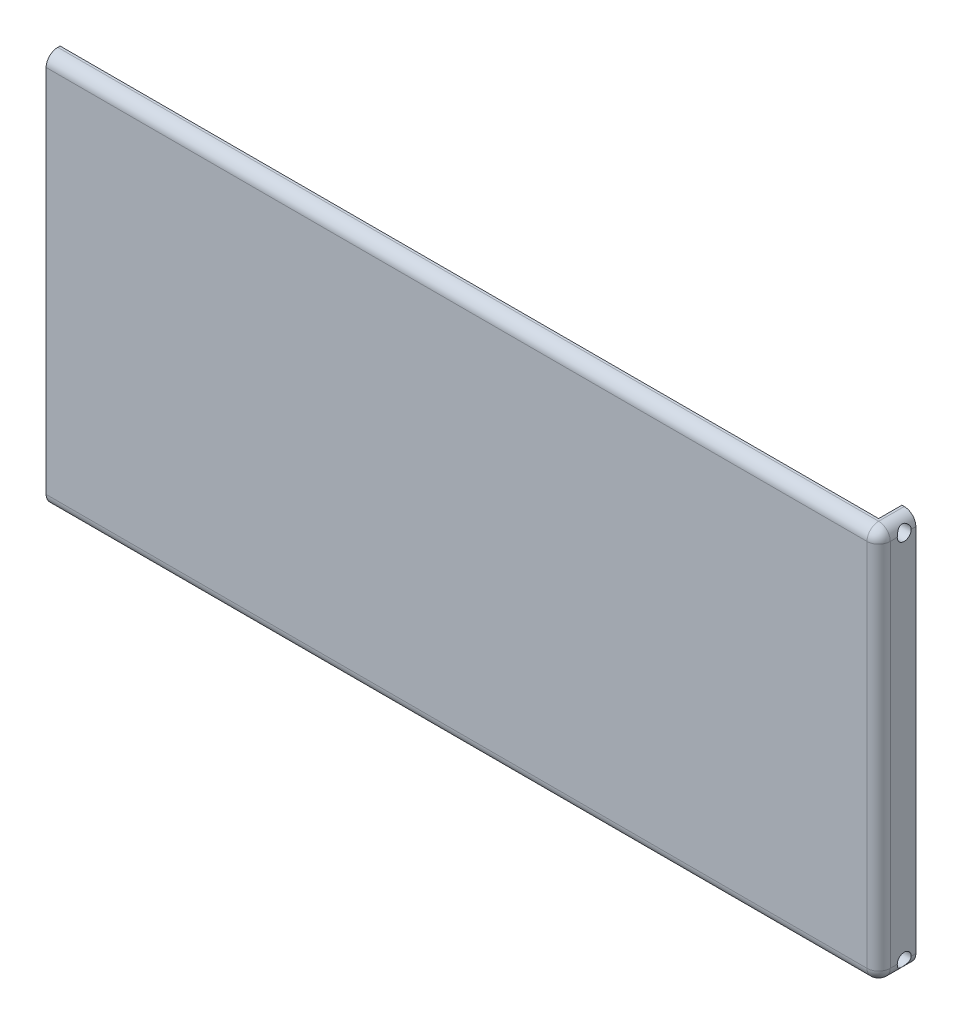
ISO-10303-21;
HEADER;
FILE_DESCRIPTION(('STEP AP214'),'2;1');
FILE_NAME('part.step','',(''),(''),'','','');
FILE_SCHEMA(('AUTOMOTIVE_DESIGN { 1 0 10303 214 1 1 1 1 }'));
ENDSEC;
DATA;
#1=APPLICATION_CONTEXT('core data for automotive mechanical design processes');
#2=APPLICATION_PROTOCOL_DEFINITION('international standard','automotive_design',2000,#1);
#3=PRODUCT_CONTEXT('',#1,'mechanical');
#4=PRODUCT('Part','Part','',(#3));
#5=PRODUCT_RELATED_PRODUCT_CATEGORY('part','',(#4));
#6=PRODUCT_DEFINITION_FORMATION('','',#4);
#7=PRODUCT_DEFINITION_CONTEXT('part definition',#1,'design');
#8=PRODUCT_DEFINITION('design','',#6,#7);
#9=PRODUCT_DEFINITION_SHAPE('','',#8);
#10=(LENGTH_UNIT() NAMED_UNIT(*) SI_UNIT(.MILLI.,.METRE.));
#11=(NAMED_UNIT(*) PLANE_ANGLE_UNIT() SI_UNIT($,.RADIAN.));
#12=(NAMED_UNIT(*) SI_UNIT($,.STERADIAN.) SOLID_ANGLE_UNIT());
#13=UNCERTAINTY_MEASURE_WITH_UNIT(LENGTH_MEASURE(1.E-05),#10,'distance_accuracy_value','');
#14=(GEOMETRIC_REPRESENTATION_CONTEXT(3) GLOBAL_UNCERTAINTY_ASSIGNED_CONTEXT((#13)) GLOBAL_UNIT_ASSIGNED_CONTEXT((#10,
#11,#12)) REPRESENTATION_CONTEXT('',''));
#15=CARTESIAN_POINT('',(0.,0.,0.));
#16=DIRECTION('',(0.,0.,1.));
#17=DIRECTION('',(1.,0.,0.));
#18=AXIS2_PLACEMENT_3D('',#15,#16,#17);
#19=CARTESIAN_POINT('',(176.,0.,0.));
#20=DIRECTION('',(1.,0.,0.));
#21=DIRECTION('',(0.,0.,-1.));
#22=AXIS2_PLACEMENT_3D('',#19,#20,#21);
#23=PLANE('',#22);
#24=DIRECTION('',(0.,0.,-1.));
#25=VECTOR('',#24,1.);
#26=CARTESIAN_POINT('',(176.,-45.,2.5));
#27=LINE('',#26,#25);
#28=CARTESIAN_POINT('',(176.,-45.,0.));
#29=VERTEX_POINT('',#28);
#30=CARTESIAN_POINT('',(176.,-45.,-5.));
#31=VERTEX_POINT('',#30);
#32=EDGE_CURVE('E416',#29,#31,#27,.T.);
#33=ORIENTED_EDGE('',*,*,#32,.T.);
#34=DIRECTION('',(0.,1.,0.));
#35=VECTOR('',#34,1.);
#36=CARTESIAN_POINT('',(176.,0.,-5.));
#37=LINE('',#36,#35);
#38=CARTESIAN_POINT('',(176.,-66.9,-5.));
#39=VERTEX_POINT('',#38);
#40=EDGE_CURVE('E250',#39,#31,#37,.T.);
#41=ORIENTED_EDGE('',*,*,#40,.F.);
#42=DIRECTION('',(0.,0.,-1.));
#43=VECTOR('',#42,1.);
#44=CARTESIAN_POINT('',(176.,-66.9,0.));
#45=LINE('',#44,#43);
#46=CARTESIAN_POINT('',(176.,-66.9,0.));
#47=VERTEX_POINT('',#46);
#48=EDGE_CURVE('E443',#47,#39,#45,.T.);
#49=ORIENTED_EDGE('',*,*,#48,.F.);
#50=DIRECTION('',(0.,1.,0.));
#51=VECTOR('',#50,1.);
#52=CARTESIAN_POINT('',(176.,0.,0.));
#53=LINE('',#52,#51);
#54=EDGE_CURVE('E289',#47,#29,#53,.T.);
#55=ORIENTED_EDGE('',*,*,#54,.T.);
#56=EDGE_LOOP('',(#33,#41,#49,#55));
#57=FACE_BOUND('',#56,.T.);
#58=ADVANCED_FACE('F39',(#57),#23,.F.);
#59=CARTESIAN_POINT('',(176.,-41.9,-5.));
#60=VERTEX_POINT('',#59);
#61=CARTESIAN_POINT('',(176.,-20.,-5.));
#62=VERTEX_POINT('',#61);
#63=EDGE_CURVE('E240',#60,#62,#37,.T.);
#64=ORIENTED_EDGE('',*,*,#63,.F.);
#65=DIRECTION('',(0.,0.,-1.));
#66=VECTOR('',#65,1.);
#67=CARTESIAN_POINT('',(176.,-41.9,0.));
#68=LINE('',#67,#66);
#69=CARTESIAN_POINT('',(176.,-41.9,0.));
#70=VERTEX_POINT('',#69);
#71=EDGE_CURVE('E221',#70,#60,#68,.T.);
#72=ORIENTED_EDGE('',*,*,#71,.F.);
#73=CARTESIAN_POINT('',(176.,-20.,0.));
#74=VERTEX_POINT('',#73);
#75=EDGE_CURVE('E561',#70,#74,#53,.T.);
#76=ORIENTED_EDGE('',*,*,#75,.T.);
#77=DIRECTION('',(0.,0.,-1.));
#78=VECTOR('',#77,1.);
#79=CARTESIAN_POINT('',(176.,-20.,2.5));
#80=LINE('',#79,#78);
#81=EDGE_CURVE('E248',#74,#62,#80,.T.);
#82=ORIENTED_EDGE('',*,*,#81,.T.);
#83=EDGE_LOOP('',(#64,#72,#76,#82));
#84=FACE_BOUND('',#83,.T.);
#85=ADVANCED_FACE('F247',(#84),#23,.F.);
#86=CARTESIAN_POINT('',(176.5,-2.5,0.5));
#87=DIRECTION('',(0.,-1.,0.));
#88=DIRECTION('',(0.,0.,-1.));
#89=AXIS2_PLACEMENT_3D('',#86,#87,#88);
#90=SPHERICAL_SURFACE('',#89,2.5);
#91=CARTESIAN_POINT('',(176.5,-2.5,0.5));
#92=DIRECTION('',(0.,0.,-1.));
#93=DIRECTION('',(-1.,0.,0.));
#94=AXIS2_PLACEMENT_3D('',#91,#92,#93);
#95=CIRCLE('',#94,2.5);
#96=CARTESIAN_POINT('',(176.5,0.,0.5));
#97=VERTEX_POINT('',#96);
#98=CARTESIAN_POINT('',(179.,-2.5,0.5));
#99=VERTEX_POINT('',#98);
#100=EDGE_CURVE('E11',#97,#99,#95,.T.);
#101=ORIENTED_EDGE('',*,*,#100,.F.);
#102=CARTESIAN_POINT('',(176.5,-2.5,0.5));
#103=DIRECTION('',(1.,0.,0.));
#104=DIRECTION('',(0.,0.,-1.));
#105=AXIS2_PLACEMENT_3D('',#102,#103,#104);
#106=CIRCLE('',#105,2.5);
#107=CARTESIAN_POINT('',(176.5,-2.5,3.));
#108=VERTEX_POINT('',#107);
#109=EDGE_CURVE('E48',#97,#108,#106,.T.);
#110=ORIENTED_EDGE('',*,*,#109,.T.);
#111=CARTESIAN_POINT('',(176.5,-2.5,0.5));
#112=DIRECTION('',(0.,-1.,0.));
#113=DIRECTION('',(0.,0.,-1.));
#114=AXIS2_PLACEMENT_3D('',#111,#112,#113);
#115=CIRCLE('',#114,2.5);
#116=EDGE_CURVE('E536',#99,#108,#115,.T.);
#117=ORIENTED_EDGE('',*,*,#116,.F.);
#118=EDGE_LOOP('',(#101,#110,#117));
#119=FACE_BOUND('',#118,.T.);
#120=ADVANCED_FACE('F41',(#119),#90,.T.);
#121=CARTESIAN_POINT('',(0.,-2.5,0.5));
#122=DIRECTION('',(-1.,0.,0.));
#123=DIRECTION('',(0.,0.,1.));
#124=AXIS2_PLACEMENT_3D('',#121,#122,#123);
#125=CYLINDRICAL_SURFACE('',#124,2.5);
#126=ORIENTED_EDGE('',*,*,#109,.F.);
#127=DIRECTION('',(1.,0.,0.));
#128=VECTOR('',#127,1.);
#129=CARTESIAN_POINT('',(0.,0.,0.5));
#130=LINE('',#129,#128);
#131=CARTESIAN_POINT('',(0.,0.,0.5));
#132=VERTEX_POINT('',#131);
#133=EDGE_CURVE('E518',#132,#97,#130,.T.);
#134=ORIENTED_EDGE('',*,*,#133,.F.);
#135=CARTESIAN_POINT('',(0.,-2.5,0.5));
#136=DIRECTION('',(1.,0.,0.));
#137=DIRECTION('',(0.,1.,0.));
#138=AXIS2_PLACEMENT_3D('',#135,#136,#137);
#139=CIRCLE('',#138,2.5);
#140=CARTESIAN_POINT('',(0.,-2.5,3.));
#141=VERTEX_POINT('',#140);
#142=EDGE_CURVE('E533',#141,#132,#139,.F.);
#143=ORIENTED_EDGE('',*,*,#142,.F.);
#144=DIRECTION('',(1.,0.,0.));
#145=VECTOR('',#144,1.);
#146=CARTESIAN_POINT('',(0.,-2.5,3.));
#147=LINE('',#146,#145);
#148=EDGE_CURVE('E524',#108,#141,#147,.F.);
#149=ORIENTED_EDGE('',*,*,#148,.F.);
#150=EDGE_LOOP('',(#126,#134,#143,#149));
#151=FACE_BOUND('',#150,.T.);
#152=ADVANCED_FACE('F355',(#151),#125,.T.);
#153=CARTESIAN_POINT('',(176.5,-2.5,3.));
#154=DIRECTION('',(0.,0.,1.));
#155=DIRECTION('',(1.,0.,0.));
#156=AXIS2_PLACEMENT_3D('',#153,#154,#155);
#157=CYLINDRICAL_SURFACE('',#156,2.5);
#158=DIRECTION('',(0.,0.,-1.));
#159=VECTOR('',#158,1.);
#160=CARTESIAN_POINT('',(176.5,0.,3.));
#161=LINE('',#160,#159);
#162=CARTESIAN_POINT('',(176.5,0.,-5.));
#163=VERTEX_POINT('',#162);
#164=EDGE_CURVE('E516',#97,#163,#161,.T.);
#165=ORIENTED_EDGE('',*,*,#164,.F.);
#166=ORIENTED_EDGE('',*,*,#100,.T.);
#167=DIRECTION('',(0.,0.,-1.));
#168=VECTOR('',#167,1.);
#169=CARTESIAN_POINT('',(179.,-2.5,3.));
#170=LINE('',#169,#168);
#171=CARTESIAN_POINT('',(179.,-2.5,-1.));
#172=VERTEX_POINT('',#171);
#173=EDGE_CURVE('E539',#172,#99,#170,.F.);
#174=ORIENTED_EDGE('',*,*,#173,.F.);
#175=CARTESIAN_POINT('',(179.,-2.5,-4.));
#176=CARTESIAN_POINT('',(179.000004439309,-2.46141859853126,-4.0000027845313));
#177=CARTESIAN_POINT('',(178.999105946057,-2.42285843054387,-3.99851040870926));
#178=CARTESIAN_POINT('',(178.995551621012,-2.34606627575521,-3.99257705398746));
#179=CARTESIAN_POINT('',(178.992896676039,-2.30783413319868,-3.98813756306016));
#180=CARTESIAN_POINT('',(178.982413344679,-2.19448438771505,-3.97053397160814));
#181=CARTESIAN_POINT('',(178.972065151484,-2.12021378969963,-3.95308350452033));
#182=CARTESIAN_POINT('',(178.945625479589,-1.97628257903692,-3.90762989498956));
#183=CARTESIAN_POINT('',(178.929543093497,-1.90661487379297,-3.87964345534541));
#184=CARTESIAN_POINT('',(178.892983110458,-1.77306659532515,-3.81419376831601));
#185=CARTESIAN_POINT('',(178.872500297488,-1.70919301905502,-3.77671926480867));
#186=CARTESIAN_POINT('',(178.827051489786,-1.58369335114981,-3.69022106982811));
#187=CARTESIAN_POINT('',(178.801863366187,-1.52260453168441,-3.6405373051202));
#188=CARTESIAN_POINT('',(178.750299626034,-1.40910822867103,-3.5325222681061));
#189=CARTESIAN_POINT('',(178.723922721585,-1.35671046299568,-3.47418145216028));
#190=CARTESIAN_POINT('',(178.66911054873,-1.25554968221389,-3.34207619186199));
#191=CARTESIAN_POINT('',(178.640819932052,-1.20802189203057,-3.26729758090873));
#192=CARTESIAN_POINT('',(178.589382811365,-1.12638535689312,-3.10915270116342));
#193=CARTESIAN_POINT('',(178.56622794184,-1.09225471872269,-3.02580072645391));
#194=CARTESIAN_POINT('',(178.533546370704,-1.04559408289796,-2.87340389490041));
#195=CARTESIAN_POINT('',(178.522078951252,-1.02983819117664,-2.80576471262413));
#196=CARTESIAN_POINT('',(178.505903133255,-1.00783834431723,-2.66819701867993));
#197=CARTESIAN_POINT('',(178.501186401974,-1.00158266197557,-2.59827143853424));
#198=CARTESIAN_POINT('',(178.499209227526,-0.998944915733497,-2.45798873620265));
#199=CARTESIAN_POINT('',(178.501963351464,-1.00258214163527,-2.38763103820198));
#200=CARTESIAN_POINT('',(178.514532550159,-1.01953930763556,-2.24872167710384));
#201=CARTESIAN_POINT('',(178.524352982365,-1.03286659451115,-2.18017142525779));
#202=CARTESIAN_POINT('',(178.54953215209,-1.06826117880711,-2.0474682682405));
#203=CARTESIAN_POINT('',(178.564817808099,-1.09021350735265,-1.98327004331357));
#204=CARTESIAN_POINT('',(178.59927138142,-1.14205073450178,-1.85930230160142));
#205=CARTESIAN_POINT('',(178.618440546493,-1.17193818359954,-1.79953421666002));
#206=CARTESIAN_POINT('',(178.662551274714,-1.24481687211719,-1.67502154348249));
#207=CARTESIAN_POINT('',(178.687916177141,-1.28918533114782,-1.61123261522008));
#208=CARTESIAN_POINT('',(178.73930163051,-1.38708006683152,-1.4913329285797));
#209=CARTESIAN_POINT('',(178.765322888765,-1.44061661727502,-1.43523091253644));
#210=CARTESIAN_POINT('',(178.819361838106,-1.56420380186981,-1.32437308045266));
#211=CARTESIAN_POINT('',(178.847151456827,-1.63551637426317,-1.2708974468476));
#212=CARTESIAN_POINT('',(178.897735153402,-1.78776199620482,-1.17685865119402));
#213=CARTESIAN_POINT('',(178.92053423521,-1.86868528240658,-1.13628253630184));
#214=CARTESIAN_POINT('',(178.957298903008,-2.03278174908363,-1.07207651922013));
#215=CARTESIAN_POINT('',(178.971731100306,-2.11549076719784,-1.04753887964838));
#216=CARTESIAN_POINT('',(178.992185731932,-2.28490127004972,-1.01299342864213));
#217=CARTESIAN_POINT('',(178.998213704142,-2.37160008679851,-1.00297604905073));
#218=CARTESIAN_POINT('',(179.000902004955,-2.53362643370796,-0.998497746835049));
#219=CARTESIAN_POINT('',(178.998733787819,-2.60888260971315,-1.00209156997941));
#220=CARTESIAN_POINT('',(178.990547780406,-2.72040100328234,-1.01580358043582));
#221=CARTESIAN_POINT('',(178.986986106036,-2.75741058505204,-1.02177916274599));
#222=CARTESIAN_POINT('',(178.978305492504,-2.83070449005625,-1.03643215371944));
#223=CARTESIAN_POINT('',(178.973186620988,-2.86698884472195,-1.04510944501988));
#224=CARTESIAN_POINT('',(178.967336882273,-2.90280107916651,-1.05509471223118));
#225=B_SPLINE_CURVE_WITH_KNOTS('',3,(#175,#176,#177,#178,#179,#180,#181,#182,#183,#184,#185,
#186,#187,#188,#189,#190,#191,#192,#193,#194,#195,#196,#197,#198,#199,#200,#201,#202,#203,#204,
#205,#206,#207,#208,#209,#210,#211,#212,#213,#214,#215,#216,#217,#218,#219,#220,#221,#222,#223,
#224),.UNSPECIFIED.,.F.,.F.,(4,2,2,2,2,2,2,2,2,2,2,2,2,2,2,2,2,2,2,2,2,2,2,2,4),(0.,
0.115664123160649,0.231269892894008,0.461003678294384,0.690374787330933,0.92001929532648,
1.16706928361681,1.41439367454124,1.69207042820954,1.96929150281511,2.17956829400843,
2.38958530472636,2.60001211297134,2.81059862847414,3.01846846328987,3.22640519236152,
3.47068059355763,3.71523154349783,3.99390638855347,4.27230051637911,4.5331282189728,
4.79378397032716,5.01868845946184,5.13154178807918,5.24439021500596),.UNSPECIFIED.);
#226=CARTESIAN_POINT('',(179.,-2.5,-4.));
#227=VERTEX_POINT('',#226);
#228=EDGE_CURVE('E358',#227,#172,#225,.T.);
#229=ORIENTED_EDGE('',*,*,#228,.F.);
#230=DIRECTION('',(0.,0.,-1.));
#231=VECTOR('',#230,1.);
#232=CARTESIAN_POINT('',(179.,-2.5,3.));
#233=LINE('',#232,#231);
#234=CARTESIAN_POINT('',(179.,-2.5,-5.));
#235=VERTEX_POINT('',#234);
#236=EDGE_CURVE('E367',#235,#227,#233,.F.);
#237=ORIENTED_EDGE('',*,*,#236,.F.);
#238=CARTESIAN_POINT('',(176.5,-2.5,-5.));
#239=DIRECTION('',(0.,0.,1.));
#240=DIRECTION('',(0.,-1.,0.));
#241=AXIS2_PLACEMENT_3D('',#238,#239,#240);
#242=CIRCLE('',#241,2.5);
#243=EDGE_CURVE('E366',#163,#235,#242,.F.);
#244=ORIENTED_EDGE('',*,*,#243,.F.);
#245=EDGE_LOOP('',(#165,#166,#174,#229,#237,#244));
#246=FACE_BOUND('',#245,.T.);
#247=ADVANCED_FACE('F348',(#246),#157,.T.);
#248=CARTESIAN_POINT('',(176.5,-82.,0.5));
#249=DIRECTION('',(0.,1.,0.));
#250=DIRECTION('',(0.,0.,1.));
#251=AXIS2_PLACEMENT_3D('',#248,#249,#250);
#252=SPHERICAL_SURFACE('',#251,2.5);
#253=CARTESIAN_POINT('',(176.5,-82.,0.5));
#254=DIRECTION('',(-1.,0.,0.));
#255=DIRECTION('',(0.,0.,1.));
#256=AXIS2_PLACEMENT_3D('',#253,#254,#255);
#257=CIRCLE('',#256,2.5);
#258=CARTESIAN_POINT('',(176.5,-84.5,0.5));
#259=VERTEX_POINT('',#258);
#260=CARTESIAN_POINT('',(176.5,-82.,3.));
#261=VERTEX_POINT('',#260);
#262=EDGE_CURVE('E520',#259,#261,#257,.T.);
#263=ORIENTED_EDGE('',*,*,#262,.F.);
#264=CARTESIAN_POINT('',(176.5,-82.,0.5));
#265=DIRECTION('',(0.,0.,1.));
#266=DIRECTION('',(1.,0.,0.));
#267=AXIS2_PLACEMENT_3D('',#264,#265,#266);
#268=CIRCLE('',#267,2.5);
#269=CARTESIAN_POINT('',(179.,-82.,0.5));
#270=VERTEX_POINT('',#269);
#271=EDGE_CURVE('E526',#259,#270,#268,.T.);
#272=ORIENTED_EDGE('',*,*,#271,.T.);
#273=CARTESIAN_POINT('',(176.5,-82.,0.5));
#274=DIRECTION('',(0.,-1.,0.));
#275=DIRECTION('',(0.,0.,-1.));
#276=AXIS2_PLACEMENT_3D('',#273,#274,#275);
#277=CIRCLE('',#276,2.5);
#278=EDGE_CURVE('E565',#261,#270,#277,.F.);
#279=ORIENTED_EDGE('',*,*,#278,.F.);
#280=EDGE_LOOP('',(#263,#272,#279));
#281=FACE_BOUND('',#280,.T.);
#282=ADVANCED_FACE('F342',(#281),#252,.T.);
#283=CARTESIAN_POINT('',(176.5,-82.,3.));
#284=DIRECTION('',(0.,0.,-1.));
#285=DIRECTION('',(-1.,0.,0.));
#286=AXIS2_PLACEMENT_3D('',#283,#284,#285);
#287=CYLINDRICAL_SURFACE('',#286,2.5);
#288=ORIENTED_EDGE('',*,*,#271,.F.);
#289=DIRECTION('',(0.,0.,1.));
#290=VECTOR('',#289,1.);
#291=CARTESIAN_POINT('',(176.5,-84.5,3.));
#292=LINE('',#291,#290);
#293=CARTESIAN_POINT('',(176.5,-84.5,-5.));
#294=VERTEX_POINT('',#293);
#295=EDGE_CURVE('E309',#294,#259,#292,.T.);
#296=ORIENTED_EDGE('',*,*,#295,.F.);
#297=CARTESIAN_POINT('',(176.5,-82.,-5.00000000000001));
#298=DIRECTION('',(0.,0.,1.));
#299=DIRECTION('',(0.,-1.,0.));
#300=AXIS2_PLACEMENT_3D('',#297,#298,#299);
#301=CIRCLE('',#300,2.5);
#302=CARTESIAN_POINT('',(179.,-82.,-5.00000000000001));
#303=VERTEX_POINT('',#302);
#304=EDGE_CURVE('E330',#303,#294,#301,.F.);
#305=ORIENTED_EDGE('',*,*,#304,.F.);
#306=DIRECTION('',(0.,0.,1.));
#307=VECTOR('',#306,1.);
#308=CARTESIAN_POINT('',(179.,-82.,3.));
#309=LINE('',#308,#307);
#310=CARTESIAN_POINT('',(179.,-82.,-4.));
#311=VERTEX_POINT('',#310);
#312=EDGE_CURVE('E313',#311,#303,#309,.F.);
#313=ORIENTED_EDGE('',*,*,#312,.F.);
#314=CARTESIAN_POINT('',(179.,-82.,-1.));
#315=CARTESIAN_POINT('',(179.000004439309,-82.0385814014687,-0.999997215468704));
#316=CARTESIAN_POINT('',(178.999105946057,-82.0771415694561,-1.00148959129074));
#317=CARTESIAN_POINT('',(178.995551621012,-82.1539337242448,-1.00742294601254));
#318=CARTESIAN_POINT('',(178.992896676039,-82.1921658668013,-1.01186243693984));
#319=CARTESIAN_POINT('',(178.982413344679,-82.3055156122849,-1.02946602839186));
#320=CARTESIAN_POINT('',(178.972065151484,-82.3797862103004,-1.04691649547968));
#321=CARTESIAN_POINT('',(178.945625479589,-82.5237174209631,-1.09237010501045));
#322=CARTESIAN_POINT('',(178.929543093497,-82.5933851262071,-1.1203565446546));
#323=CARTESIAN_POINT('',(178.892983110458,-82.7269334046749,-1.185806231684));
#324=CARTESIAN_POINT('',(178.872500297488,-82.790806980945,-1.22328073519134));
#325=CARTESIAN_POINT('',(178.827051489786,-82.9163066488502,-1.3097789301719));
#326=CARTESIAN_POINT('',(178.801863366187,-82.9773954683156,-1.35946269487981));
#327=CARTESIAN_POINT('',(178.750299626034,-83.090891771329,-1.46747773189392));
#328=CARTESIAN_POINT('',(178.723922721585,-83.1432895370043,-1.52581854783975));
#329=CARTESIAN_POINT('',(178.66911054873,-83.2444503177861,-1.65792380813803));
#330=CARTESIAN_POINT('',(178.640819932052,-83.2919781079694,-1.73270241909129));
#331=CARTESIAN_POINT('',(178.589382811365,-83.3736146431069,-1.8908472988366));
#332=CARTESIAN_POINT('',(178.56622794184,-83.4077452812773,-1.97419927354611));
#333=CARTESIAN_POINT('',(178.533546370704,-83.454405917102,-2.12659610509961));
#334=CARTESIAN_POINT('',(178.522078951252,-83.4701618088233,-2.19423528737588));
#335=CARTESIAN_POINT('',(178.505903133255,-83.4921616556828,-2.33180298132008));
#336=CARTESIAN_POINT('',(178.501186401974,-83.4984173380244,-2.40172856146578));
#337=CARTESIAN_POINT('',(178.499209227526,-83.5010550842665,-2.54201126379737));
#338=CARTESIAN_POINT('',(178.501963351464,-83.4974178583647,-2.61236896179804));
#339=CARTESIAN_POINT('',(178.514532550159,-83.4804606923644,-2.75127832289617));
#340=CARTESIAN_POINT('',(178.524352982365,-83.4671334054888,-2.81982857474222));
#341=CARTESIAN_POINT('',(178.54953215209,-83.4317388211929,-2.95253173175951));
#342=CARTESIAN_POINT('',(178.564817808099,-83.4097864926473,-3.01672995668644));
#343=CARTESIAN_POINT('',(178.59927138142,-83.3579492654982,-3.14069769839859));
#344=CARTESIAN_POINT('',(178.618440546493,-83.3280618164004,-3.20046578333998));
#345=CARTESIAN_POINT('',(178.662551274714,-83.2551831278828,-3.32497845651752));
#346=CARTESIAN_POINT('',(178.687916177141,-83.2108146688522,-3.38876738477993));
#347=CARTESIAN_POINT('',(178.73930163051,-83.1129199331685,-3.50866707142031));
#348=CARTESIAN_POINT('',(178.765322888765,-83.059383382725,-3.56476908746357));
#349=CARTESIAN_POINT('',(178.819361838106,-82.9357961981302,-3.67562691954735));
#350=CARTESIAN_POINT('',(178.847151456827,-82.8644836257368,-3.72910255315241));
#351=CARTESIAN_POINT('',(178.897735153402,-82.7122380037952,-3.82314134880599));
#352=CARTESIAN_POINT('',(178.92053423521,-82.6313147175934,-3.86371746369817));
#353=CARTESIAN_POINT('',(178.957298903008,-82.4672182509164,-3.92792348077987));
#354=CARTESIAN_POINT('',(178.971731100306,-82.3845092328022,-3.95246112035162));
#355=CARTESIAN_POINT('',(178.992185731932,-82.2150987299503,-3.98700657135787));
#356=CARTESIAN_POINT('',(178.998213704142,-82.1283999132015,-3.99702395094927));
#357=CARTESIAN_POINT('',(179.000902004955,-81.966373566292,-4.00150225316495));
#358=CARTESIAN_POINT('',(178.998733787819,-81.8911173902868,-3.99790843002059));
#359=CARTESIAN_POINT('',(178.990547780406,-81.7795989967176,-3.98419641956417));
#360=CARTESIAN_POINT('',(178.986986106036,-81.7425894149479,-3.97822083725401));
#361=CARTESIAN_POINT('',(178.978305492504,-81.6692955099437,-3.96356784628055));
#362=CARTESIAN_POINT('',(178.973186620988,-81.633011155278,-3.95489055498012));
#363=CARTESIAN_POINT('',(178.967336882273,-81.5971989208335,-3.94490528776882));
#364=B_SPLINE_CURVE_WITH_KNOTS('',3,(#314,#315,#316,#317,#318,#319,#320,#321,#322,#323,#324,
#325,#326,#327,#328,#329,#330,#331,#332,#333,#334,#335,#336,#337,#338,#339,#340,#341,#342,#343,
#344,#345,#346,#347,#348,#349,#350,#351,#352,#353,#354,#355,#356,#357,#358,#359,#360,#361,#362,
#363),.UNSPECIFIED.,.F.,.F.,(4,2,2,2,2,2,2,2,2,2,2,2,2,2,2,2,2,2,2,2,2,2,2,2,4),(0.,
0.115664123160656,0.231269892894003,0.461003678294386,0.690374787330953,0.920019295326483,
1.16706928361683,1.41439367454125,1.69207042820955,1.96929150281511,2.17956829400843,
2.38958530472636,2.60001211297134,2.81059862847413,3.01846846328986,3.2264051923615,
3.47068059355764,3.71523154349782,3.99390638855348,4.27230051637911,4.53312821897277,
4.79378397032716,5.01868845946185,5.13154178807918,5.24439021500595),.UNSPECIFIED.);
#365=CARTESIAN_POINT('',(179.,-82.,-1.));
#366=VERTEX_POINT('',#365);
#367=EDGE_CURVE('E321',#366,#311,#364,.T.);
#368=ORIENTED_EDGE('',*,*,#367,.F.);
#369=DIRECTION('',(0.,0.,1.));
#370=VECTOR('',#369,1.);
#371=CARTESIAN_POINT('',(179.,-82.,3.));
#372=LINE('',#371,#370);
#373=EDGE_CURVE('E317',#270,#366,#372,.F.);
#374=ORIENTED_EDGE('',*,*,#373,.F.);
#375=EDGE_LOOP('',(#288,#296,#305,#313,#368,#374));
#376=FACE_BOUND('',#375,.T.);
#377=ADVANCED_FACE('F336',(#376),#287,.T.);
#378=CARTESIAN_POINT('',(0.,-82.,0.5));
#379=DIRECTION('',(1.,0.,0.));
#380=DIRECTION('',(0.,0.,-1.));
#381=AXIS2_PLACEMENT_3D('',#378,#379,#380);
#382=CYLINDRICAL_SURFACE('',#381,2.5);
#383=DIRECTION('',(-1.,0.,0.));
#384=VECTOR('',#383,1.);
#385=CARTESIAN_POINT('',(0.,-84.5,0.5));
#386=LINE('',#385,#384);
#387=CARTESIAN_POINT('',(0.,-84.5,0.5));
#388=VERTEX_POINT('',#387);
#389=EDGE_CURVE('E305',#259,#388,#386,.T.);
#390=ORIENTED_EDGE('',*,*,#389,.F.);
#391=ORIENTED_EDGE('',*,*,#262,.T.);
#392=DIRECTION('',(-1.,0.,0.));
#393=VECTOR('',#392,1.);
#394=CARTESIAN_POINT('',(0.,-82.,3.));
#395=LINE('',#394,#393);
#396=CARTESIAN_POINT('',(0.,-82.,3.));
#397=VERTEX_POINT('',#396);
#398=EDGE_CURVE('E568',#397,#261,#395,.F.);
#399=ORIENTED_EDGE('',*,*,#398,.F.);
#400=CARTESIAN_POINT('',(0.,-82.,0.5));
#401=DIRECTION('',(1.,0.,0.));
#402=DIRECTION('',(0.,1.,0.));
#403=AXIS2_PLACEMENT_3D('',#400,#401,#402);
#404=CIRCLE('',#403,2.5);
#405=EDGE_CURVE('E571',#388,#397,#404,.F.);
#406=ORIENTED_EDGE('',*,*,#405,.F.);
#407=EDGE_LOOP('',(#390,#391,#399,#406));
#408=FACE_BOUND('',#407,.T.);
#409=ADVANCED_FACE('F341',(#408),#382,.T.);
#410=CARTESIAN_POINT('',(176.5,0.,0.5));
#411=DIRECTION('',(0.,-1.,0.));
#412=DIRECTION('',(0.,0.,-1.));
#413=AXIS2_PLACEMENT_3D('',#410,#411,#412);
#414=CYLINDRICAL_SURFACE('',#413,2.5);
#415=DIRECTION('',(0.,-1.,0.));
#416=VECTOR('',#415,1.);
#417=CARTESIAN_POINT('',(179.,0.,0.5));
#418=LINE('',#417,#416);
#419=EDGE_CURVE('E298',#99,#270,#418,.T.);
#420=ORIENTED_EDGE('',*,*,#419,.F.);
#421=ORIENTED_EDGE('',*,*,#116,.T.);
#422=DIRECTION('',(0.,-1.,0.));
#423=VECTOR('',#422,1.);
#424=CARTESIAN_POINT('',(176.5,0.,3.));
#425=LINE('',#424,#423);
#426=EDGE_CURVE('E301',#261,#108,#425,.F.);
#427=ORIENTED_EDGE('',*,*,#426,.F.);
#428=ORIENTED_EDGE('',*,*,#278,.T.);
#429=EDGE_LOOP('',(#420,#421,#427,#428));
#430=FACE_BOUND('',#429,.T.);
#431=ADVANCED_FACE('F344',(#430),#414,.T.);
#432=CARTESIAN_POINT('',(176.,-82.,-2.5));
#433=DIRECTION('',(1.,0.,0.));
#434=DIRECTION('',(0.,0.,1.));
#435=AXIS2_PLACEMENT_3D('',#432,#433,#434);
#436=CIRCLE('',#435,1.5);
#437=CARTESIAN_POINT('',(176.,-82.,-1.));
#438=VERTEX_POINT('',#437);
#439=EDGE_CURVE('E479',#438,#438,#436,.T.);
#440=ORIENTED_EDGE('',*,*,#439,.T.);
#441=EDGE_LOOP('',(#440));
#442=FACE_BOUND('',#441,.T.);
#443=DIRECTION('',(0.,0.,-1.));
#444=VECTOR('',#443,1.);
#445=CARTESIAN_POINT('',(176.,-70.,2.5));
#446=LINE('',#445,#444);
#447=CARTESIAN_POINT('',(176.,-70.,0.));
#448=VERTEX_POINT('',#447);
#449=CARTESIAN_POINT('',(176.,-70.,-5.));
#450=VERTEX_POINT('',#449);
#451=EDGE_CURVE('E462',#448,#450,#446,.T.);
#452=ORIENTED_EDGE('',*,*,#451,.T.);
#453=CARTESIAN_POINT('',(176.,-84.5,-5.));
#454=VERTEX_POINT('',#453);
#455=EDGE_CURVE('E256',#454,#450,#37,.T.);
#456=ORIENTED_EDGE('',*,*,#455,.F.);
#457=DIRECTION('',(0.,0.,1.));
#458=VECTOR('',#457,1.);
#459=CARTESIAN_POINT('',(176.,-84.5,3.));
#460=LINE('',#459,#458);
#461=CARTESIAN_POINT('',(176.,-84.5,0.));
#462=VERTEX_POINT('',#461);
#463=EDGE_CURVE('E484',#454,#462,#460,.T.);
#464=ORIENTED_EDGE('',*,*,#463,.T.);
#465=EDGE_CURVE('E285',#462,#448,#53,.T.);
#466=ORIENTED_EDGE('',*,*,#465,.T.);
#467=EDGE_LOOP('',(#452,#456,#464,#466));
#468=FACE_BOUND('',#467,.T.);
#469=ADVANCED_FACE('F383',(#442,#468),#23,.F.);
#470=CARTESIAN_POINT('',(0.,0.,3.));
#471=DIRECTION('',(1.,0.,0.));
#472=DIRECTION('',(0.,1.,0.));
#473=AXIS2_PLACEMENT_3D('',#470,#471,#472);
#474=PLANE('',#473);
#475=DIRECTION('',(0.,-1.,0.));
#476=VECTOR('',#475,1.);
#477=CARTESIAN_POINT('',(0.,0.,3.));
#478=LINE('',#477,#476);
#479=EDGE_CURVE('E273',#141,#397,#478,.T.);
#480=ORIENTED_EDGE('',*,*,#479,.F.);
#481=ORIENTED_EDGE('',*,*,#142,.T.);
#482=DIRECTION('',(0.,0.,-1.));
#483=VECTOR('',#482,1.);
#484=CARTESIAN_POINT('',(0.,0.,3.));
#485=LINE('',#484,#483);
#486=CARTESIAN_POINT('',(0.,0.,0.));
#487=VERTEX_POINT('',#486);
#488=EDGE_CURVE('E276',#132,#487,#485,.T.);
#489=ORIENTED_EDGE('',*,*,#488,.T.);
#490=DIRECTION('',(0.,-1.,0.));
#491=VECTOR('',#490,1.);
#492=CARTESIAN_POINT('',(0.,0.,0.));
#493=LINE('',#492,#491);
#494=CARTESIAN_POINT('',(0.,-84.5,0.));
#495=VERTEX_POINT('',#494);
#496=EDGE_CURVE('E272',#487,#495,#493,.T.);
#497=ORIENTED_EDGE('',*,*,#496,.T.);
#498=DIRECTION('',(0.,0.,-1.));
#499=VECTOR('',#498,1.);
#500=CARTESIAN_POINT('',(0.,-84.5,3.));
#501=LINE('',#500,#499);
#502=EDGE_CURVE('E295',#388,#495,#501,.T.);
#503=ORIENTED_EDGE('',*,*,#502,.F.);
#504=ORIENTED_EDGE('',*,*,#405,.T.);
#505=EDGE_LOOP('',(#480,#481,#489,#497,#503,#504));
#506=FACE_BOUND('',#505,.T.);
#507=ADVANCED_FACE('F399',(#506),#474,.F.);
#508=CARTESIAN_POINT('',(0.,-84.5,3.));
#509=DIRECTION('',(0.,1.,0.));
#510=DIRECTION('',(0.,0.,1.));
#511=AXIS2_PLACEMENT_3D('',#508,#509,#510);
#512=PLANE('',#511);
#513=DIRECTION('',(-1.,0.,0.));
#514=VECTOR('',#513,1.);
#515=CARTESIAN_POINT('',(179.,-84.5,-5.));
#516=LINE('',#515,#514);
#517=EDGE_CURVE('E491',#294,#454,#516,.T.);
#518=ORIENTED_EDGE('',*,*,#517,.F.);
#519=ORIENTED_EDGE('',*,*,#295,.T.);
#520=ORIENTED_EDGE('',*,*,#389,.T.);
#521=ORIENTED_EDGE('',*,*,#502,.T.);
#522=DIRECTION('',(1.,0.,0.));
#523=VECTOR('',#522,1.);
#524=CARTESIAN_POINT('',(0.,-84.5,0.));
#525=LINE('',#524,#523);
#526=EDGE_CURVE('E281',#495,#462,#525,.T.);
#527=ORIENTED_EDGE('',*,*,#526,.T.);
#528=ORIENTED_EDGE('',*,*,#463,.F.);
#529=EDGE_LOOP('',(#518,#519,#520,#521,#527,#528));
#530=FACE_BOUND('',#529,.T.);
#531=ADVANCED_FACE('F396',(#530),#512,.F.);
#532=CARTESIAN_POINT('',(0.,0.,3.));
#533=DIRECTION('',(0.,-1.,0.));
#534=DIRECTION('',(0.,0.,-1.));
#535=AXIS2_PLACEMENT_3D('',#532,#533,#534);
#536=PLANE('',#535);
#537=ORIENTED_EDGE('',*,*,#488,.F.);
#538=ORIENTED_EDGE('',*,*,#133,.T.);
#539=ORIENTED_EDGE('',*,*,#164,.T.);
#540=DIRECTION('',(-1.,0.,0.));
#541=VECTOR('',#540,1.);
#542=CARTESIAN_POINT('',(179.,0.,-5.));
#543=LINE('',#542,#541);
#544=CARTESIAN_POINT('',(176.,0.,-5.));
#545=VERTEX_POINT('',#544);
#546=EDGE_CURVE('E268',#163,#545,#543,.T.);
#547=ORIENTED_EDGE('',*,*,#546,.T.);
#548=DIRECTION('',(0.,0.,1.));
#549=VECTOR('',#548,1.);
#550=CARTESIAN_POINT('',(176.,0.,3.));
#551=LINE('',#550,#549);
#552=CARTESIAN_POINT('',(176.,0.,0.));
#553=VERTEX_POINT('',#552);
#554=EDGE_CURVE('E262',#545,#553,#551,.T.);
#555=ORIENTED_EDGE('',*,*,#554,.T.);
#556=DIRECTION('',(-1.,0.,0.));
#557=VECTOR('',#556,1.);
#558=CARTESIAN_POINT('',(0.,0.,0.));
#559=LINE('',#558,#557);
#560=EDGE_CURVE('E277',#553,#487,#559,.T.);
#561=ORIENTED_EDGE('',*,*,#560,.T.);
#562=EDGE_LOOP('',(#537,#538,#539,#547,#555,#561));
#563=FACE_BOUND('',#562,.T.);
#564=ADVANCED_FACE('F389',(#563),#536,.F.);
#565=CARTESIAN_POINT('',(0.,0.,3.));
#566=DIRECTION('',(0.,0.,1.));
#567=DIRECTION('',(1.,0.,0.));
#568=AXIS2_PLACEMENT_3D('',#565,#566,#567);
#569=PLANE('',#568);
#570=ORIENTED_EDGE('',*,*,#426,.T.);
#571=ORIENTED_EDGE('',*,*,#148,.T.);
#572=ORIENTED_EDGE('',*,*,#479,.T.);
#573=ORIENTED_EDGE('',*,*,#398,.T.);
#574=EDGE_LOOP('',(#570,#571,#572,#573));
#575=FACE_BOUND('',#574,.T.);
#576=ADVANCED_FACE('F386',(#575),#569,.T.);
#577=CARTESIAN_POINT('',(0.,0.,0.));
#578=DIRECTION('',(0.,0.,1.));
#579=DIRECTION('',(1.,0.,0.));
#580=AXIS2_PLACEMENT_3D('',#577,#578,#579);
#581=PLANE('',#580);
#582=ORIENTED_EDGE('',*,*,#496,.F.);
#583=ORIENTED_EDGE('',*,*,#560,.F.);
#584=CARTESIAN_POINT('',(176.,-16.9,0.));
#585=VERTEX_POINT('',#584);
#586=EDGE_CURVE('E284',#585,#553,#53,.T.);
#587=ORIENTED_EDGE('',*,*,#586,.F.);
#588=DIRECTION('',(0.,-1.,0.));
#589=VECTOR('',#588,1.);
#590=CARTESIAN_POINT('',(176.,0.,0.));
#591=LINE('',#590,#589);
#592=EDGE_CURVE('E600',#585,#74,#591,.T.);
#593=ORIENTED_EDGE('',*,*,#592,.T.);
#594=ORIENTED_EDGE('',*,*,#75,.F.);
#595=DIRECTION('',(0.,-1.,0.));
#596=VECTOR('',#595,1.);
#597=CARTESIAN_POINT('',(176.,0.,0.));
#598=LINE('',#597,#596);
#599=EDGE_CURVE('E454',#70,#29,#598,.T.);
#600=ORIENTED_EDGE('',*,*,#599,.T.);
#601=ORIENTED_EDGE('',*,*,#54,.F.);
#602=DIRECTION('',(0.,-1.,0.));
#603=VECTOR('',#602,1.);
#604=CARTESIAN_POINT('',(176.,0.,0.));
#605=LINE('',#604,#603);
#606=EDGE_CURVE('E470',#47,#448,#605,.T.);
#607=ORIENTED_EDGE('',*,*,#606,.T.);
#608=ORIENTED_EDGE('',*,*,#465,.F.);
#609=ORIENTED_EDGE('',*,*,#526,.F.);
#610=EDGE_LOOP('',(#582,#583,#587,#593,#594,#600,#601,#607,#608,#609));
#611=FACE_BOUND('',#610,.T.);
#612=ADVANCED_FACE('F381',(#611),#581,.F.);
#613=CARTESIAN_POINT('',(176.,-2.5,-2.5));
#614=DIRECTION('',(-1.,0.,0.));
#615=DIRECTION('',(0.,0.,1.));
#616=AXIS2_PLACEMENT_3D('',#613,#614,#615);
#617=CIRCLE('',#616,1.5);
#618=CARTESIAN_POINT('',(176.,-2.5,-1.));
#619=VERTEX_POINT('',#618);
#620=EDGE_CURVE('E494',#619,#619,#617,.T.);
#621=ORIENTED_EDGE('',*,*,#620,.F.);
#622=EDGE_LOOP('',(#621));
#623=FACE_BOUND('',#622,.T.);
#624=CARTESIAN_POINT('',(176.,-16.9,-5.));
#625=VERTEX_POINT('',#624);
#626=EDGE_CURVE('E251',#625,#545,#37,.T.);
#627=ORIENTED_EDGE('',*,*,#626,.F.);
#628=DIRECTION('',(0.,0.,-1.));
#629=VECTOR('',#628,1.);
#630=CARTESIAN_POINT('',(176.,-16.9,0.));
#631=LINE('',#630,#629);
#632=EDGE_CURVE('E505',#585,#625,#631,.T.);
#633=ORIENTED_EDGE('',*,*,#632,.F.);
#634=ORIENTED_EDGE('',*,*,#586,.T.);
#635=ORIENTED_EDGE('',*,*,#554,.F.);
#636=EDGE_LOOP('',(#627,#633,#634,#635));
#637=FACE_BOUND('',#636,.T.);
#638=ADVANCED_FACE('F378',(#623,#637),#23,.F.);
#639=CARTESIAN_POINT('',(179.,0.,-5.));
#640=DIRECTION('',(0.,0.,1.));
#641=DIRECTION('',(0.,-1.,0.));
#642=AXIS2_PLACEMENT_3D('',#639,#640,#641);
#643=PLANE('',#642);
#644=DIRECTION('',(0.,-1.,0.));
#645=VECTOR('',#644,1.);
#646=CARTESIAN_POINT('',(178.5,-41.9,-5.));
#647=LINE('',#646,#645);
#648=CARTESIAN_POINT('',(178.5,-41.9,-5.));
#649=VERTEX_POINT('',#648);
#650=CARTESIAN_POINT('',(178.5,-45.,-5.00000000000001));
#651=VERTEX_POINT('',#650);
#652=EDGE_CURVE('E242',#649,#651,#647,.T.);
#653=ORIENTED_EDGE('',*,*,#652,.F.);
#654=DIRECTION('',(1.,0.,0.));
#655=VECTOR('',#654,1.);
#656=CARTESIAN_POINT('',(176.,-41.9,-5.));
#657=LINE('',#656,#655);
#658=EDGE_CURVE('E225',#60,#649,#657,.T.);
#659=ORIENTED_EDGE('',*,*,#658,.F.);
#660=ORIENTED_EDGE('',*,*,#63,.T.);
#661=DIRECTION('',(1.,0.,0.));
#662=VECTOR('',#661,1.);
#663=CARTESIAN_POINT('',(176.,-20.,-5.));
#664=LINE('',#663,#662);
#665=CARTESIAN_POINT('',(178.5,-20.,-5.));
#666=VERTEX_POINT('',#665);
#667=EDGE_CURVE('E660',#62,#666,#664,.T.);
#668=ORIENTED_EDGE('',*,*,#667,.T.);
#669=DIRECTION('',(0.,-1.,0.));
#670=VECTOR('',#669,1.);
#671=CARTESIAN_POINT('',(178.5,-16.9,-5.));
#672=LINE('',#671,#670);
#673=CARTESIAN_POINT('',(178.5,-16.9,-5.));
#674=VERTEX_POINT('',#673);
#675=EDGE_CURVE('E631',#674,#666,#672,.T.);
#676=ORIENTED_EDGE('',*,*,#675,.F.);
#677=DIRECTION('',(1.,0.,0.));
#678=VECTOR('',#677,1.);
#679=CARTESIAN_POINT('',(176.,-16.9,-5.));
#680=LINE('',#679,#678);
#681=EDGE_CURVE('E511',#625,#674,#680,.T.);
#682=ORIENTED_EDGE('',*,*,#681,.F.);
#683=ORIENTED_EDGE('',*,*,#626,.T.);
#684=ORIENTED_EDGE('',*,*,#546,.F.);
#685=ORIENTED_EDGE('',*,*,#243,.T.);
#686=DIRECTION('',(0.,1.,0.));
#687=VECTOR('',#686,1.);
#688=CARTESIAN_POINT('',(179.,0.,-5.));
#689=LINE('',#688,#687);
#690=EDGE_CURVE('E263',#303,#235,#689,.T.);
#691=ORIENTED_EDGE('',*,*,#690,.F.);
#692=ORIENTED_EDGE('',*,*,#304,.T.);
#693=ORIENTED_EDGE('',*,*,#517,.T.);
#694=ORIENTED_EDGE('',*,*,#455,.T.);
#695=DIRECTION('',(1.,0.,0.));
#696=VECTOR('',#695,1.);
#697=CARTESIAN_POINT('',(176.,-70.,-5.));
#698=LINE('',#697,#696);
#699=CARTESIAN_POINT('',(178.5,-70.,-5.00000000000001));
#700=VERTEX_POINT('',#699);
#701=EDGE_CURVE('E450',#450,#700,#698,.T.);
#702=ORIENTED_EDGE('',*,*,#701,.T.);
#703=DIRECTION('',(0.,-1.,0.));
#704=VECTOR('',#703,1.);
#705=CARTESIAN_POINT('',(178.5,-66.9,-5.));
#706=LINE('',#705,#704);
#707=CARTESIAN_POINT('',(178.5,-66.9,-5.));
#708=VERTEX_POINT('',#707);
#709=EDGE_CURVE('E431',#708,#700,#706,.T.);
#710=ORIENTED_EDGE('',*,*,#709,.F.);
#711=DIRECTION('',(1.,0.,0.));
#712=VECTOR('',#711,1.);
#713=CARTESIAN_POINT('',(176.,-66.9,-5.));
#714=LINE('',#713,#712);
#715=EDGE_CURVE('E428',#39,#708,#714,.T.);
#716=ORIENTED_EDGE('',*,*,#715,.F.);
#717=ORIENTED_EDGE('',*,*,#40,.T.);
#718=DIRECTION('',(1.,0.,0.));
#719=VECTOR('',#718,1.);
#720=CARTESIAN_POINT('',(176.,-45.,-5.));
#721=LINE('',#720,#719);
#722=EDGE_CURVE('E425',#31,#651,#721,.T.);
#723=ORIENTED_EDGE('',*,*,#722,.T.);
#724=EDGE_LOOP('',(#653,#659,#660,#668,#676,#682,#683,#684,#685,#691,#692,#693,#694,#702,#710,
#716,#717,#723));
#725=FACE_BOUND('',#724,.T.);
#726=ADVANCED_FACE('F238',(#725),#643,.F.);
#727=CARTESIAN_POINT('',(179.,0.,0.));
#728=DIRECTION('',(1.,0.,0.));
#729=DIRECTION('',(0.,0.,-1.));
#730=AXIS2_PLACEMENT_3D('',#727,#728,#729);
#731=PLANE('',#730);
#732=ORIENTED_EDGE('',*,*,#690,.T.);
#733=ORIENTED_EDGE('',*,*,#236,.T.);
#734=CARTESIAN_POINT('',(179.,-2.5,-2.5));
#735=DIRECTION('',(-1.,0.,0.));
#736=DIRECTION('',(0.,0.,1.));
#737=AXIS2_PLACEMENT_3D('',#734,#735,#736);
#738=CIRCLE('',#737,1.5);
#739=EDGE_CURVE('E257',#227,#172,#738,.T.);
#740=ORIENTED_EDGE('',*,*,#739,.T.);
#741=ORIENTED_EDGE('',*,*,#173,.T.);
#742=ORIENTED_EDGE('',*,*,#419,.T.);
#743=ORIENTED_EDGE('',*,*,#373,.T.);
#744=CARTESIAN_POINT('',(179.,-82.,-2.5));
#745=DIRECTION('',(1.,0.,0.));
#746=DIRECTION('',(0.,0.,1.));
#747=AXIS2_PLACEMENT_3D('',#744,#745,#746);
#748=CIRCLE('',#747,1.5);
#749=EDGE_CURVE('E480',#311,#366,#748,.T.);
#750=ORIENTED_EDGE('',*,*,#749,.F.);
#751=ORIENTED_EDGE('',*,*,#312,.T.);
#752=EDGE_LOOP('',(#732,#733,#740,#741,#742,#743,#750,#751));
#753=FACE_BOUND('',#752,.T.);
#754=ADVANCED_FACE('F373',(#753),#731,.T.);
#755=CARTESIAN_POINT('',(179.,-2.5,-2.5));
#756=DIRECTION('',(-1.,0.,0.));
#757=DIRECTION('',(0.,0.,1.));
#758=AXIS2_PLACEMENT_3D('',#755,#756,#757);
#759=CYLINDRICAL_SURFACE('',#758,1.5);
#760=ORIENTED_EDGE('',*,*,#739,.F.);
#761=ORIENTED_EDGE('',*,*,#228,.T.);
#762=EDGE_LOOP('',(#760,#761));
#763=FACE_BOUND('',#762,.T.);
#764=ORIENTED_EDGE('',*,*,#620,.T.);
#765=EDGE_LOOP('',(#764));
#766=FACE_BOUND('',#765,.T.);
#767=ADVANCED_FACE('F369',(#763,#766),#759,.F.);
#768=CARTESIAN_POINT('',(179.,-82.,-2.5));
#769=DIRECTION('',(-1.,0.,0.));
#770=DIRECTION('',(0.,0.,1.));
#771=AXIS2_PLACEMENT_3D('',#768,#769,#770);
#772=CYLINDRICAL_SURFACE('',#771,1.5);
#773=ORIENTED_EDGE('',*,*,#749,.T.);
#774=ORIENTED_EDGE('',*,*,#367,.T.);
#775=EDGE_LOOP('',(#773,#774));
#776=FACE_BOUND('',#775,.T.);
#777=ORIENTED_EDGE('',*,*,#439,.F.);
#778=EDGE_LOOP('',(#777));
#779=FACE_BOUND('',#778,.T.);
#780=ADVANCED_FACE('F332',(#776,#779),#772,.F.);
#781=CARTESIAN_POINT('',(176.,-66.9,2.5));
#782=DIRECTION('',(-1.,0.,0.));
#783=DIRECTION('',(0.,0.,1.));
#784=AXIS2_PLACEMENT_3D('',#781,#782,#783);
#785=PLANE('',#784);
#786=CARTESIAN_POINT('',(176.,-66.9,2.5));
#787=VERTEX_POINT('',#786);
#788=EDGE_CURVE('E436',#787,#47,#45,.T.);
#789=ORIENTED_EDGE('',*,*,#788,.F.);
#790=DIRECTION('',(0.,-1.,0.));
#791=VECTOR('',#790,1.);
#792=CARTESIAN_POINT('',(176.,-66.9,2.5));
#793=LINE('',#792,#791);
#794=CARTESIAN_POINT('',(176.,-70.,2.5));
#795=VERTEX_POINT('',#794);
#796=EDGE_CURVE('E467',#787,#795,#793,.T.);
#797=ORIENTED_EDGE('',*,*,#796,.T.);
#798=EDGE_CURVE('E463',#795,#448,#446,.T.);
#799=ORIENTED_EDGE('',*,*,#798,.T.);
#800=ORIENTED_EDGE('',*,*,#606,.F.);
#801=EDGE_LOOP('',(#789,#797,#799,#800));
#802=FACE_BOUND('',#801,.T.);
#803=ADVANCED_FACE('F674',(#802),#785,.F.);
#804=CARTESIAN_POINT('',(176.,-66.9,0.));
#805=DIRECTION('',(0.,-1.,0.));
#806=DIRECTION('',(0.,0.,-1.));
#807=AXIS2_PLACEMENT_3D('',#804,#805,#806);
#808=CYLINDRICAL_SURFACE('',#807,2.5);
#809=CARTESIAN_POINT('',(176.,-70.,0.));
#810=DIRECTION('',(0.,-1.,0.));
#811=DIRECTION('',(0.,0.,1.));
#812=AXIS2_PLACEMENT_3D('',#809,#810,#811);
#813=CIRCLE('',#812,2.5);
#814=CARTESIAN_POINT('',(178.5,-70.,0.));
#815=VERTEX_POINT('',#814);
#816=EDGE_CURVE('E458',#815,#795,#813,.T.);
#817=ORIENTED_EDGE('',*,*,#816,.T.);
#818=ORIENTED_EDGE('',*,*,#796,.F.);
#819=CARTESIAN_POINT('',(176.,-66.9,0.));
#820=DIRECTION('',(0.,-1.,0.));
#821=DIRECTION('',(0.,0.,1.));
#822=AXIS2_PLACEMENT_3D('',#819,#820,#821);
#823=CIRCLE('',#822,2.5);
#824=CARTESIAN_POINT('',(178.5,-66.9,0.));
#825=VERTEX_POINT('',#824);
#826=EDGE_CURVE('E440',#825,#787,#823,.T.);
#827=ORIENTED_EDGE('',*,*,#826,.F.);
#828=DIRECTION('',(0.,-1.,0.));
#829=VECTOR('',#828,1.);
#830=CARTESIAN_POINT('',(178.5,-66.9,0.));
#831=LINE('',#830,#829);
#832=EDGE_CURVE('E471',#825,#815,#831,.T.);
#833=ORIENTED_EDGE('',*,*,#832,.T.);
#834=EDGE_LOOP('',(#817,#818,#827,#833));
#835=FACE_BOUND('',#834,.T.);
#836=ADVANCED_FACE('F679',(#835),#808,.F.);
#837=CARTESIAN_POINT('',(178.5,-66.9,-5.));
#838=DIRECTION('',(1.,0.,0.));
#839=DIRECTION('',(0.,0.,-1.));
#840=AXIS2_PLACEMENT_3D('',#837,#838,#839);
#841=PLANE('',#840);
#842=DIRECTION('',(0.,0.,1.));
#843=VECTOR('',#842,1.);
#844=CARTESIAN_POINT('',(178.5,-70.,-5.));
#845=LINE('',#844,#843);
#846=EDGE_CURVE('E453',#700,#815,#845,.T.);
#847=ORIENTED_EDGE('',*,*,#846,.T.);
#848=ORIENTED_EDGE('',*,*,#832,.F.);
#849=DIRECTION('',(0.,0.,1.));
#850=VECTOR('',#849,1.);
#851=CARTESIAN_POINT('',(178.5,-66.9,-5.));
#852=LINE('',#851,#850);
#853=EDGE_CURVE('E435',#708,#825,#852,.T.);
#854=ORIENTED_EDGE('',*,*,#853,.F.);
#855=ORIENTED_EDGE('',*,*,#709,.T.);
#856=EDGE_LOOP('',(#847,#848,#854,#855));
#857=FACE_BOUND('',#856,.T.);
#858=ADVANCED_FACE('F690',(#857),#841,.F.);
#859=CARTESIAN_POINT('',(176.,-66.9,0.));
#860=DIRECTION('',(0.,1.,0.));
#861=DIRECTION('',(0.,0.,1.));
#862=AXIS2_PLACEMENT_3D('',#859,#860,#861);
#863=PLANE('',#862);
#864=ORIENTED_EDGE('',*,*,#788,.T.);
#865=ORIENTED_EDGE('',*,*,#48,.T.);
#866=ORIENTED_EDGE('',*,*,#715,.T.);
#867=ORIENTED_EDGE('',*,*,#853,.T.);
#868=ORIENTED_EDGE('',*,*,#826,.T.);
#869=EDGE_LOOP('',(#864,#865,#866,#867,#868));
#870=FACE_BOUND('',#869,.T.);
#871=ADVANCED_FACE('F676',(#870),#863,.F.);
#872=CARTESIAN_POINT('',(176.,-70.,0.));
#873=DIRECTION('',(0.,1.,0.));
#874=DIRECTION('',(0.,0.,1.));
#875=AXIS2_PLACEMENT_3D('',#872,#873,#874);
#876=PLANE('',#875);
#877=ORIENTED_EDGE('',*,*,#798,.F.);
#878=ORIENTED_EDGE('',*,*,#816,.F.);
#879=ORIENTED_EDGE('',*,*,#846,.F.);
#880=ORIENTED_EDGE('',*,*,#701,.F.);
#881=ORIENTED_EDGE('',*,*,#451,.F.);
#882=EDGE_LOOP('',(#877,#878,#879,#880,#881));
#883=FACE_BOUND('',#882,.T.);
#884=ADVANCED_FACE('F681',(#883),#876,.T.);
#885=CARTESIAN_POINT('',(176.,-16.9,2.5));
#886=DIRECTION('',(-1.,0.,0.));
#887=DIRECTION('',(0.,0.,1.));
#888=AXIS2_PLACEMENT_3D('',#885,#886,#887);
#889=PLANE('',#888);
#890=CARTESIAN_POINT('',(176.,-16.9,2.5));
#891=VERTEX_POINT('',#890);
#892=EDGE_CURVE('E644',#891,#585,#631,.T.);
#893=ORIENTED_EDGE('',*,*,#892,.F.);
#894=DIRECTION('',(0.,-1.,0.));
#895=VECTOR('',#894,1.);
#896=CARTESIAN_POINT('',(176.,-16.9,2.5));
#897=LINE('',#896,#895);
#898=CARTESIAN_POINT('',(176.,-20.,2.5));
#899=VERTEX_POINT('',#898);
#900=EDGE_CURVE('E625',#891,#899,#897,.T.);
#901=ORIENTED_EDGE('',*,*,#900,.T.);
#902=EDGE_CURVE('E650',#899,#74,#80,.T.);
#903=ORIENTED_EDGE('',*,*,#902,.T.);
#904=ORIENTED_EDGE('',*,*,#592,.F.);
#905=EDGE_LOOP('',(#893,#901,#903,#904));
#906=FACE_BOUND('',#905,.T.);
#907=ADVANCED_FACE('F666',(#906),#889,.F.);
#908=CARTESIAN_POINT('',(176.,-16.9,0.));
#909=DIRECTION('',(0.,-1.,0.));
#910=DIRECTION('',(0.,0.,-1.));
#911=AXIS2_PLACEMENT_3D('',#908,#909,#910);
#912=CYLINDRICAL_SURFACE('',#911,2.5);
#913=CARTESIAN_POINT('',(176.,-20.,0.));
#914=DIRECTION('',(0.,-1.,0.));
#915=DIRECTION('',(0.,0.,1.));
#916=AXIS2_PLACEMENT_3D('',#913,#914,#915);
#917=CIRCLE('',#916,2.5);
#918=CARTESIAN_POINT('',(178.5,-20.,0.));
#919=VERTEX_POINT('',#918);
#920=EDGE_CURVE('E655',#919,#899,#917,.T.);
#921=ORIENTED_EDGE('',*,*,#920,.T.);
#922=ORIENTED_EDGE('',*,*,#900,.F.);
#923=CARTESIAN_POINT('',(176.,-16.9,0.));
#924=DIRECTION('',(0.,-1.,0.));
#925=DIRECTION('',(0.,0.,1.));
#926=AXIS2_PLACEMENT_3D('',#923,#924,#925);
#927=CIRCLE('',#926,2.5);
#928=CARTESIAN_POINT('',(178.5,-16.9,0.));
#929=VERTEX_POINT('',#928);
#930=EDGE_CURVE('E634',#929,#891,#927,.T.);
#931=ORIENTED_EDGE('',*,*,#930,.F.);
#932=DIRECTION('',(0.,-1.,0.));
#933=VECTOR('',#932,1.);
#934=CARTESIAN_POINT('',(178.5,-16.9,0.));
#935=LINE('',#934,#933);
#936=EDGE_CURVE('E628',#929,#919,#935,.T.);
#937=ORIENTED_EDGE('',*,*,#936,.T.);
#938=EDGE_LOOP('',(#921,#922,#931,#937));
#939=FACE_BOUND('',#938,.T.);
#940=ADVANCED_FACE('F688',(#939),#912,.F.);
#941=CARTESIAN_POINT('',(178.5,-16.9,-5.));
#942=DIRECTION('',(1.,0.,0.));
#943=DIRECTION('',(0.,0.,-1.));
#944=AXIS2_PLACEMENT_3D('',#941,#942,#943);
#945=PLANE('',#944);
#946=DIRECTION('',(0.,0.,1.));
#947=VECTOR('',#946,1.);
#948=CARTESIAN_POINT('',(178.5,-20.,-5.));
#949=LINE('',#948,#947);
#950=EDGE_CURVE('E63',#666,#919,#949,.T.);
#951=ORIENTED_EDGE('',*,*,#950,.T.);
#952=ORIENTED_EDGE('',*,*,#936,.F.);
#953=DIRECTION('',(0.,0.,1.));
#954=VECTOR('',#953,1.);
#955=CARTESIAN_POINT('',(178.5,-16.9,-5.));
#956=LINE('',#955,#954);
#957=EDGE_CURVE('E638',#674,#929,#956,.T.);
#958=ORIENTED_EDGE('',*,*,#957,.F.);
#959=ORIENTED_EDGE('',*,*,#675,.T.);
#960=EDGE_LOOP('',(#951,#952,#958,#959));
#961=FACE_BOUND('',#960,.T.);
#962=ADVANCED_FACE('F855',(#961),#945,.F.);
#963=CARTESIAN_POINT('',(176.,-16.9,0.));
#964=DIRECTION('',(0.,1.,0.));
#965=DIRECTION('',(0.,0.,1.));
#966=AXIS2_PLACEMENT_3D('',#963,#964,#965);
#967=PLANE('',#966);
#968=ORIENTED_EDGE('',*,*,#892,.T.);
#969=ORIENTED_EDGE('',*,*,#632,.T.);
#970=ORIENTED_EDGE('',*,*,#681,.T.);
#971=ORIENTED_EDGE('',*,*,#957,.T.);
#972=ORIENTED_EDGE('',*,*,#930,.T.);
#973=EDGE_LOOP('',(#968,#969,#970,#971,#972));
#974=FACE_BOUND('',#973,.T.);
#975=ADVANCED_FACE('F865',(#974),#967,.F.);
#976=CARTESIAN_POINT('',(176.,-20.,0.));
#977=DIRECTION('',(0.,1.,0.));
#978=DIRECTION('',(0.,0.,1.));
#979=AXIS2_PLACEMENT_3D('',#976,#977,#978);
#980=PLANE('',#979);
#981=ORIENTED_EDGE('',*,*,#902,.F.);
#982=ORIENTED_EDGE('',*,*,#920,.F.);
#983=ORIENTED_EDGE('',*,*,#950,.F.);
#984=ORIENTED_EDGE('',*,*,#667,.F.);
#985=ORIENTED_EDGE('',*,*,#81,.F.);
#986=EDGE_LOOP('',(#981,#982,#983,#984,#985));
#987=FACE_BOUND('',#986,.T.);
#988=ADVANCED_FACE('F664',(#987),#980,.T.);
#989=CARTESIAN_POINT('',(176.,-41.9,2.5));
#990=DIRECTION('',(-1.,0.,0.));
#991=DIRECTION('',(0.,0.,1.));
#992=AXIS2_PLACEMENT_3D('',#989,#990,#991);
#993=PLANE('',#992);
#994=CARTESIAN_POINT('',(176.,-41.9,2.5));
#995=VERTEX_POINT('',#994);
#996=EDGE_CURVE('E228',#995,#70,#68,.T.);
#997=ORIENTED_EDGE('',*,*,#996,.F.);
#998=DIRECTION('',(0.,-1.,0.));
#999=VECTOR('',#998,1.);
#1000=CARTESIAN_POINT('',(176.,-41.9,2.5));
#1001=LINE('',#1000,#999);
#1002=CARTESIAN_POINT('',(176.,-45.,2.5));
#1003=VERTEX_POINT('',#1002);
#1004=EDGE_CURVE('E603',#995,#1003,#1001,.T.);
#1005=ORIENTED_EDGE('',*,*,#1004,.T.);
#1006=EDGE_CURVE('E234',#1003,#29,#27,.T.);
#1007=ORIENTED_EDGE('',*,*,#1006,.T.);
#1008=ORIENTED_EDGE('',*,*,#599,.F.);
#1009=EDGE_LOOP('',(#997,#1005,#1007,#1008));
#1010=FACE_BOUND('',#1009,.T.);
#1011=ADVANCED_FACE('F883',(#1010),#993,.F.);
#1012=CARTESIAN_POINT('',(176.,-41.9,0.));
#1013=DIRECTION('',(0.,-1.,0.));
#1014=DIRECTION('',(0.,0.,-1.));
#1015=AXIS2_PLACEMENT_3D('',#1012,#1013,#1014);
#1016=CYLINDRICAL_SURFACE('',#1015,2.5);
#1017=CARTESIAN_POINT('',(176.,-45.,0.));
#1018=DIRECTION('',(0.,-1.,0.));
#1019=DIRECTION('',(0.,0.,1.));
#1020=AXIS2_PLACEMENT_3D('',#1017,#1018,#1019);
#1021=CIRCLE('',#1020,2.5);
#1022=CARTESIAN_POINT('',(178.5,-45.,0.));
#1023=VERTEX_POINT('',#1022);
#1024=EDGE_CURVE('E422',#1023,#1003,#1021,.T.);
#1025=ORIENTED_EDGE('',*,*,#1024,.T.);
#1026=ORIENTED_EDGE('',*,*,#1004,.F.);
#1027=CARTESIAN_POINT('',(176.,-41.9,0.));
#1028=DIRECTION('',(0.,-1.,0.));
#1029=DIRECTION('',(0.,0.,1.));
#1030=AXIS2_PLACEMENT_3D('',#1027,#1028,#1029);
#1031=CIRCLE('',#1030,2.5);
#1032=CARTESIAN_POINT('',(178.5,-41.9,0.));
#1033=VERTEX_POINT('',#1032);
#1034=EDGE_CURVE('E611',#1033,#995,#1031,.T.);
#1035=ORIENTED_EDGE('',*,*,#1034,.F.);
#1036=DIRECTION('',(0.,-1.,0.));
#1037=VECTOR('',#1036,1.);
#1038=CARTESIAN_POINT('',(178.5,-41.9,0.));
#1039=LINE('',#1038,#1037);
#1040=EDGE_CURVE('E606',#1033,#1023,#1039,.T.);
#1041=ORIENTED_EDGE('',*,*,#1040,.T.);
#1042=EDGE_LOOP('',(#1025,#1026,#1035,#1041));
#1043=FACE_BOUND('',#1042,.T.);
#1044=ADVANCED_FACE('F893',(#1043),#1016,.F.);
#1045=CARTESIAN_POINT('',(178.5,-41.9,-5.));
#1046=DIRECTION('',(1.,0.,0.));
#1047=DIRECTION('',(0.,0.,-1.));
#1048=AXIS2_PLACEMENT_3D('',#1045,#1046,#1047);
#1049=PLANE('',#1048);
#1050=DIRECTION('',(0.,0.,1.));
#1051=VECTOR('',#1050,1.);
#1052=CARTESIAN_POINT('',(178.5,-45.,-5.));
#1053=LINE('',#1052,#1051);
#1054=EDGE_CURVE('E55',#651,#1023,#1053,.T.);
#1055=ORIENTED_EDGE('',*,*,#1054,.T.);
#1056=ORIENTED_EDGE('',*,*,#1040,.F.);
#1057=DIRECTION('',(0.,0.,1.));
#1058=VECTOR('',#1057,1.);
#1059=CARTESIAN_POINT('',(178.5,-41.9,-5.));
#1060=LINE('',#1059,#1058);
#1061=EDGE_CURVE('E244',#649,#1033,#1060,.T.);
#1062=ORIENTED_EDGE('',*,*,#1061,.F.);
#1063=ORIENTED_EDGE('',*,*,#652,.T.);
#1064=EDGE_LOOP('',(#1055,#1056,#1062,#1063));
#1065=FACE_BOUND('',#1064,.T.);
#1066=ADVANCED_FACE('F903',(#1065),#1049,.F.);
#1067=CARTESIAN_POINT('',(176.,-41.9,0.));
#1068=DIRECTION('',(0.,1.,0.));
#1069=DIRECTION('',(0.,0.,1.));
#1070=AXIS2_PLACEMENT_3D('',#1067,#1068,#1069);
#1071=PLANE('',#1070);
#1072=ORIENTED_EDGE('',*,*,#996,.T.);
#1073=ORIENTED_EDGE('',*,*,#71,.T.);
#1074=ORIENTED_EDGE('',*,*,#658,.T.);
#1075=ORIENTED_EDGE('',*,*,#1061,.T.);
#1076=ORIENTED_EDGE('',*,*,#1034,.T.);
#1077=EDGE_LOOP('',(#1072,#1073,#1074,#1075,#1076));
#1078=FACE_BOUND('',#1077,.T.);
#1079=ADVANCED_FACE('F223',(#1078),#1071,.F.);
#1080=CARTESIAN_POINT('',(176.,-45.,0.));
#1081=DIRECTION('',(0.,1.,0.));
#1082=DIRECTION('',(0.,0.,1.));
#1083=AXIS2_PLACEMENT_3D('',#1080,#1081,#1082);
#1084=PLANE('',#1083);
#1085=ORIENTED_EDGE('',*,*,#1006,.F.);
#1086=ORIENTED_EDGE('',*,*,#1024,.F.);
#1087=ORIENTED_EDGE('',*,*,#1054,.F.);
#1088=ORIENTED_EDGE('',*,*,#722,.F.);
#1089=ORIENTED_EDGE('',*,*,#32,.F.);
#1090=EDGE_LOOP('',(#1085,#1086,#1087,#1088,#1089));
#1091=FACE_BOUND('',#1090,.T.);
#1092=ADVANCED_FACE('F922',(#1091),#1084,.T.);
#1093=CLOSED_SHELL('',(#58,#85,#120,#152,#247,#282,#377,#409,#431,#469,#507,#531,#564,#576,#612,
#638,#726,#754,#767,#780,#803,#836,#858,#871,#884,#907,#940,#962,#975,#988,#1011,#1044,#1066,
#1079,#1092));
#1094=MANIFOLD_SOLID_BREP('B2',#1093);
#1095=ADVANCED_BREP_SHAPE_REPRESENTATION('',(#18,#1094),#14);
#1096=SHAPE_DEFINITION_REPRESENTATION(#9,#1095);
ENDSEC;
END-ISO-10303-21;
